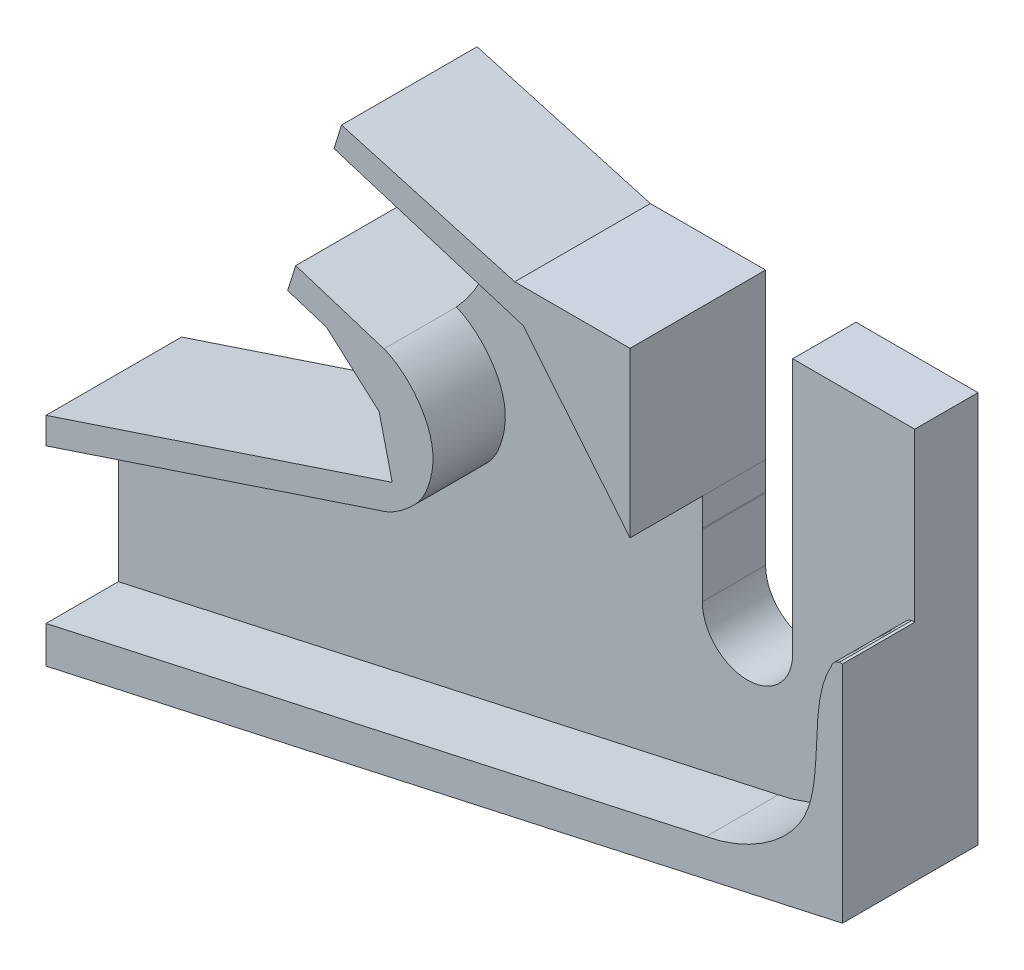
ISO-10303-21;
HEADER;
FILE_DESCRIPTION(('STEP AP214'),'2;1');
FILE_NAME('part.step','',(''),(''),'','','');
FILE_SCHEMA(('AUTOMOTIVE_DESIGN { 1 0 10303 214 1 1 1 1 }'));
ENDSEC;
DATA;
#1=APPLICATION_CONTEXT('core data for automotive mechanical design processes');
#2=APPLICATION_PROTOCOL_DEFINITION('international standard','automotive_design',2000,#1);
#3=PRODUCT_CONTEXT('',#1,'mechanical');
#4=PRODUCT('Part','Part','',(#3));
#5=PRODUCT_RELATED_PRODUCT_CATEGORY('part','',(#4));
#6=PRODUCT_DEFINITION_FORMATION('','',#4);
#7=PRODUCT_DEFINITION_CONTEXT('part definition',#1,'design');
#8=PRODUCT_DEFINITION('design','',#6,#7);
#9=PRODUCT_DEFINITION_SHAPE('','',#8);
#10=(LENGTH_UNIT() NAMED_UNIT(*) SI_UNIT(.MILLI.,.METRE.));
#11=(NAMED_UNIT(*) PLANE_ANGLE_UNIT() SI_UNIT($,.RADIAN.));
#12=(NAMED_UNIT(*) SI_UNIT($,.STERADIAN.) SOLID_ANGLE_UNIT());
#13=UNCERTAINTY_MEASURE_WITH_UNIT(LENGTH_MEASURE(1.E-05),#10,'distance_accuracy_value','');
#14=(GEOMETRIC_REPRESENTATION_CONTEXT(3) GLOBAL_UNCERTAINTY_ASSIGNED_CONTEXT((#13)) GLOBAL_UNIT_ASSIGNED_CONTEXT((#10,
#11,#12)) REPRESENTATION_CONTEXT('',''));
#15=CARTESIAN_POINT('',(0.,0.,0.));
#16=DIRECTION('',(0.,0.,1.));
#17=DIRECTION('',(1.,0.,0.));
#18=AXIS2_PLACEMENT_3D('',#15,#16,#17);
#19=CARTESIAN_POINT('',(83.6786939982744,168.728153838485,7.));
#20=CARTESIAN_POINT('',(88.7746337498864,174.312097995887,7.));
#21=CARTESIAN_POINT('',(88.0764137081904,182.068482242816,7.));
#22=B_SPLINE_CURVE_WITH_KNOTS('',2,(#19,#20,#21),.UNSPECIFIED.,.F.,.F.,(3,3),(0.,1.),.UNSPECIFIED.);
#23=DIRECTION('',(0.,0.,-1.));
#24=VECTOR('',#23,1.);
#25=SURFACE_OF_LINEAR_EXTRUSION('',#22,#24);
#26=CARTESIAN_POINT('',(83.6786939982744,168.728153838485,0.));
#27=CARTESIAN_POINT('',(88.7746337498864,174.312097995887,0.));
#28=CARTESIAN_POINT('',(88.0764137081904,182.068482242816,0.));
#29=B_SPLINE_CURVE_WITH_KNOTS('',2,(#26,#27,#28),.UNSPECIFIED.,.F.,.F.,(3,3),(0.,1.),.UNSPECIFIED.);
#30=CARTESIAN_POINT('',(83.6786939982744,168.728153838485,0.));
#31=VERTEX_POINT('',#30);
#32=CARTESIAN_POINT('',(88.0764137081904,182.068482242816,0.));
#33=VERTEX_POINT('',#32);
#34=EDGE_CURVE('E525',#31,#33,#29,.T.);
#35=ORIENTED_EDGE('',*,*,#34,.F.);
#36=DIRECTION('',(0.,0.,-1.));
#37=VECTOR('',#36,1.);
#38=CARTESIAN_POINT('',(83.6786939982744,168.728153838485,7.));
#39=LINE('',#38,#37);
#40=CARTESIAN_POINT('',(83.6786939982744,168.728153838485,7.));
#41=VERTEX_POINT('',#40);
#42=EDGE_CURVE('E12',#41,#31,#39,.T.);
#43=ORIENTED_EDGE('',*,*,#42,.F.);
#44=CARTESIAN_POINT('',(88.0764137081904,182.068482242816,7.));
#45=VERTEX_POINT('',#44);
#46=EDGE_CURVE('E158',#41,#45,#22,.T.);
#47=ORIENTED_EDGE('',*,*,#46,.T.);
#48=DIRECTION('',(0.,0.,-1.));
#49=VECTOR('',#48,1.);
#50=CARTESIAN_POINT('',(88.0764137081904,182.068482242816,7.));
#51=LINE('',#50,#49);
#52=EDGE_CURVE('E645',#45,#33,#51,.T.);
#53=ORIENTED_EDGE('',*,*,#52,.T.);
#54=EDGE_LOOP('',(#35,#43,#47,#53));
#55=FACE_BOUND('',#54,.T.);
#56=ADVANCED_FACE('F154',(#55),#25,.T.);
#57=CARTESIAN_POINT('',(56.2757722145099,177.420071131067,7.));
#58=DIRECTION('',(-0.302344558633703,-0.953198703243238,0.));
#59=DIRECTION('',(0.953198703243238,-0.302344558633703,0.));
#60=AXIS2_PLACEMENT_3D('',#57,#58,#59);
#61=PLANE('',#60);
#62=DIRECTION('',(-0.953198703243238,0.302344558633703,0.));
#63=VECTOR('',#62,1.);
#64=CARTESIAN_POINT('',(56.2757722145099,177.420071131067,0.));
#65=LINE('',#64,#63);
#66=CARTESIAN_POINT('',(73.917241091847,171.824383575869,0.));
#67=VERTEX_POINT('',#66);
#68=EDGE_CURVE('E569',#31,#67,#65,.T.);
#69=ORIENTED_EDGE('',*,*,#68,.T.);
#70=DIRECTION('',(0.,0.,-1.));
#71=VECTOR('',#70,1.);
#72=CARTESIAN_POINT('',(73.917241091847,171.824383575869,7.));
#73=LINE('',#72,#71);
#74=CARTESIAN_POINT('',(73.917241091847,171.824383575869,15.));
#75=VERTEX_POINT('',#74);
#76=EDGE_CURVE('E164',#75,#67,#73,.T.);
#77=ORIENTED_EDGE('',*,*,#76,.F.);
#78=DIRECTION('',(-0.953198703243238,0.302344558633703,0.));
#79=VECTOR('',#78,1.);
#80=CARTESIAN_POINT('',(56.2757722145099,177.420071131067,15.));
#81=LINE('',#80,#79);
#82=CARTESIAN_POINT('',(83.6786939982744,168.728153838485,15.));
#83=VERTEX_POINT('',#82);
#84=EDGE_CURVE('E430',#83,#75,#81,.T.);
#85=ORIENTED_EDGE('',*,*,#84,.F.);
#86=DIRECTION('',(0.,0.,-1.));
#87=VECTOR('',#86,1.);
#88=CARTESIAN_POINT('',(83.6786939982744,168.728153838485,15.));
#89=LINE('',#88,#87);
#90=EDGE_CURVE('E466',#83,#41,#89,.T.);
#91=ORIENTED_EDGE('',*,*,#90,.T.);
#92=ORIENTED_EDGE('',*,*,#42,.T.);
#93=EDGE_LOOP('',(#69,#77,#85,#91,#92));
#94=FACE_BOUND('',#93,.T.);
#95=ADVANCED_FACE('F841',(#94),#61,.F.);
#96=CARTESIAN_POINT('',(17.6414688773371,-5.59568755519761,7.));
#97=DIRECTION('',(0.953198703243238,-0.302344558633704,0.));
#98=DIRECTION('',(0.302344558633704,0.953198703243238,0.));
#99=AXIS2_PLACEMENT_3D('',#96,#97,#98);
#100=PLANE('',#99);
#101=DIRECTION('',(-0.302344558633704,-0.953198703243238,0.));
#102=VECTOR('',#101,1.);
#103=CARTESIAN_POINT('',(17.6414688773371,-5.59568755519761,0.));
#104=LINE('',#103,#102);
#105=CARTESIAN_POINT('',(73.0183410125951,168.990430175946,0.));
#106=VERTEX_POINT('',#105);
#107=EDGE_CURVE('E575',#67,#106,#104,.T.);
#108=ORIENTED_EDGE('',*,*,#107,.T.);
#109=DIRECTION('',(0.,0.,-1.));
#110=VECTOR('',#109,1.);
#111=CARTESIAN_POINT('',(73.0183410125951,168.990430175946,7.));
#112=LINE('',#111,#110);
#113=CARTESIAN_POINT('',(73.0183410125951,168.990430175946,15.));
#114=VERTEX_POINT('',#113);
#115=EDGE_CURVE('E715',#114,#106,#112,.T.);
#116=ORIENTED_EDGE('',*,*,#115,.F.);
#117=DIRECTION('',(-0.302344558633704,-0.953198703243238,0.));
#118=VECTOR('',#117,1.);
#119=CARTESIAN_POINT('',(17.6414688773371,-5.59568755519761,15.));
#120=LINE('',#119,#118);
#121=EDGE_CURVE('E439',#75,#114,#120,.T.);
#122=ORIENTED_EDGE('',*,*,#121,.F.);
#123=ORIENTED_EDGE('',*,*,#76,.T.);
#124=EDGE_LOOP('',(#108,#116,#122,#123));
#125=FACE_BOUND('',#124,.T.);
#126=ADVANCED_FACE('F725',(#125),#100,.F.);
#127=CARTESIAN_POINT('',(55.3768721352582,174.586117731144,7.));
#128=DIRECTION('',(0.302344558633704,0.953198703243238,0.));
#129=DIRECTION('',(-0.953198703243238,0.302344558633704,0.));
#130=AXIS2_PLACEMENT_3D('',#127,#128,#129);
#131=PLANE('',#130);
#132=DIRECTION('',(0.953198703243238,-0.302344558633704,0.));
#133=VECTOR('',#132,1.);
#134=CARTESIAN_POINT('',(55.3768721352582,174.586117731144,0.));
#135=LINE('',#134,#133);
#136=CARTESIAN_POINT('',(77.2981363976021,167.632924293574,0.));
#137=VERTEX_POINT('',#136);
#138=EDGE_CURVE('E578',#106,#137,#135,.T.);
#139=ORIENTED_EDGE('',*,*,#138,.T.);
#140=DIRECTION('',(0.,0.,-1.));
#141=VECTOR('',#140,1.);
#142=CARTESIAN_POINT('',(77.2981363976021,167.632924293574,7.));
#143=LINE('',#142,#141);
#144=CARTESIAN_POINT('',(77.2981363976021,167.632924293574,15.));
#145=VERTEX_POINT('',#144);
#146=EDGE_CURVE('E711',#145,#137,#143,.T.);
#147=ORIENTED_EDGE('',*,*,#146,.F.);
#148=DIRECTION('',(0.953198703243238,-0.302344558633704,0.));
#149=VECTOR('',#148,1.);
#150=CARTESIAN_POINT('',(55.3768721352582,174.586117731144,15.));
#151=LINE('',#150,#149);
#152=EDGE_CURVE('E443',#114,#145,#151,.T.);
#153=ORIENTED_EDGE('',*,*,#152,.F.);
#154=ORIENTED_EDGE('',*,*,#115,.T.);
#155=EDGE_LOOP('',(#139,#147,#153,#154));
#156=FACE_BOUND('',#155,.T.);
#157=ADVANCED_FACE('F737',(#156),#131,.F.);
#158=CARTESIAN_POINT('',(117.192322274538,132.292301888184,7.));
#159=DIRECTION('',(0.663095933339968,0.74853442351571,0.));
#160=DIRECTION('',(-0.74853442351571,0.663095933339968,0.));
#161=AXIS2_PLACEMENT_3D('',#158,#159,#160);
#162=PLANE('',#161);
#163=DIRECTION('',(0.74853442351571,-0.663095933339968,0.));
#164=VECTOR('',#163,1.);
#165=CARTESIAN_POINT('',(117.192322274538,132.292301888184,0.));
#166=LINE('',#165,#164);
#167=CARTESIAN_POINT('',(83.1348948537238,162.46237946016,0.));
#168=VERTEX_POINT('',#167);
#169=EDGE_CURVE('E581',#137,#168,#166,.T.);
#170=ORIENTED_EDGE('',*,*,#169,.T.);
#171=DIRECTION('',(0.,0.,-1.));
#172=VECTOR('',#171,1.);
#173=CARTESIAN_POINT('',(83.1348948537238,162.46237946016,7.));
#174=LINE('',#173,#172);
#175=CARTESIAN_POINT('',(83.1348948537238,162.46237946016,15.));
#176=VERTEX_POINT('',#175);
#177=EDGE_CURVE('E707',#176,#168,#174,.T.);
#178=ORIENTED_EDGE('',*,*,#177,.F.);
#179=DIRECTION('',(0.74853442351571,-0.663095933339968,0.));
#180=VECTOR('',#179,1.);
#181=CARTESIAN_POINT('',(117.192322274538,132.292301888184,15.));
#182=LINE('',#181,#180);
#183=EDGE_CURVE('E447',#145,#176,#182,.T.);
#184=ORIENTED_EDGE('',*,*,#183,.F.);
#185=ORIENTED_EDGE('',*,*,#146,.T.);
#186=EDGE_LOOP('',(#170,#178,#184,#185));
#187=FACE_BOUND('',#186,.T.);
#188=ADVANCED_FACE('F741',(#187),#162,.F.);
#189=CARTESIAN_POINT('',(115.435467231037,27.6599799177272,7.));
#190=DIRECTION('',(0.972472371101005,0.233018212689887,0.));
#191=DIRECTION('',(-0.233018212689887,0.972472371101005,0.));
#192=AXIS2_PLACEMENT_3D('',#189,#190,#191);
#193=PLANE('',#192);
#194=DIRECTION('',(0.233018212689887,-0.972472371101005,0.));
#195=VECTOR('',#194,1.);
#196=CARTESIAN_POINT('',(115.435467231037,27.6599799177272,0.));
#197=LINE('',#196,#195);
#198=CARTESIAN_POINT('',(84.5894393959199,156.392019708049,0.));
#199=VERTEX_POINT('',#198);
#200=EDGE_CURVE('E584',#168,#199,#197,.T.);
#201=ORIENTED_EDGE('',*,*,#200,.T.);
#202=DIRECTION('',(0.,0.,-1.));
#203=VECTOR('',#202,1.);
#204=CARTESIAN_POINT('',(84.5894393959199,156.392019708049,7.));
#205=LINE('',#204,#203);
#206=CARTESIAN_POINT('',(84.5894393959199,156.392019708049,15.));
#207=VERTEX_POINT('',#206);
#208=EDGE_CURVE('E703',#207,#199,#205,.T.);
#209=ORIENTED_EDGE('',*,*,#208,.F.);
#210=DIRECTION('',(0.233018212689887,-0.972472371101005,0.));
#211=VECTOR('',#210,1.);
#212=CARTESIAN_POINT('',(115.435467231037,27.6599799177272,15.));
#213=LINE('',#212,#211);
#214=EDGE_CURVE('E451',#176,#207,#213,.T.);
#215=ORIENTED_EDGE('',*,*,#214,.F.);
#216=ORIENTED_EDGE('',*,*,#177,.T.);
#217=EDGE_LOOP('',(#201,#209,#215,#216));
#218=FACE_BOUND('',#217,.T.);
#219=ADVANCED_FACE('F746',(#218),#193,.F.);
#220=CARTESIAN_POINT('',(-38.3932698895026,115.517687304981,7.));
#221=DIRECTION('',(0.315394959956781,-0.948960494032212,0.));
#222=DIRECTION('',(0.948960494032212,0.315394959956781,0.));
#223=AXIS2_PLACEMENT_3D('',#220,#221,#222);
#224=PLANE('',#223);
#225=DIRECTION('',(-0.948960494032212,-0.315394959956781,0.));
#226=VECTOR('',#225,1.);
#227=CARTESIAN_POINT('',(-38.3932698895026,115.517687304981,0.));
#228=LINE('',#227,#226);
#229=CARTESIAN_POINT('',(46.2859167985872,143.661523494811,0.));
#230=VERTEX_POINT('',#229);
#231=EDGE_CURVE('E587',#199,#230,#228,.T.);
#232=ORIENTED_EDGE('',*,*,#231,.T.);
#233=DIRECTION('',(0.,0.,-1.));
#234=VECTOR('',#233,1.);
#235=CARTESIAN_POINT('',(46.2859167985872,143.661523494811,7.));
#236=LINE('',#235,#234);
#237=CARTESIAN_POINT('',(46.2859167985872,143.661523494811,15.));
#238=VERTEX_POINT('',#237);
#239=EDGE_CURVE('E699',#238,#230,#236,.T.);
#240=ORIENTED_EDGE('',*,*,#239,.F.);
#241=DIRECTION('',(-0.948960494032212,-0.315394959956781,0.));
#242=VECTOR('',#241,1.);
#243=CARTESIAN_POINT('',(-38.3932698895026,115.517687304981,15.));
#244=LINE('',#243,#242);
#245=EDGE_CURVE('E455',#207,#238,#244,.T.);
#246=ORIENTED_EDGE('',*,*,#245,.F.);
#247=ORIENTED_EDGE('',*,*,#208,.T.);
#248=EDGE_LOOP('',(#232,#240,#246,#247));
#249=FACE_BOUND('',#248,.T.);
#250=ADVANCED_FACE('F749',(#249),#224,.F.);
#251=CARTESIAN_POINT('',(46.2859167985872,0.,7.));
#252=DIRECTION('',(1.,0.,0.));
#253=DIRECTION('',(0.,0.,-1.));
#254=AXIS2_PLACEMENT_3D('',#251,#252,#253);
#255=PLANE('',#254);
#256=DIRECTION('',(0.,-1.,0.));
#257=VECTOR('',#256,1.);
#258=CARTESIAN_POINT('',(46.2859167985872,0.,0.));
#259=LINE('',#258,#257);
#260=CARTESIAN_POINT('',(46.2859167985872,119.6347243386,0.));
#261=VERTEX_POINT('',#260);
#262=EDGE_CURVE('E590',#230,#261,#259,.T.);
#263=ORIENTED_EDGE('',*,*,#262,.T.);
#264=DIRECTION('',(0.,0.,-1.));
#265=VECTOR('',#264,1.);
#266=CARTESIAN_POINT('',(46.2859167985872,119.6347243386,7.));
#267=LINE('',#266,#265);
#268=CARTESIAN_POINT('',(46.2859167985872,119.6347243386,15.));
#269=VERTEX_POINT('',#268);
#270=EDGE_CURVE('E695',#269,#261,#267,.T.);
#271=ORIENTED_EDGE('',*,*,#270,.F.);
#272=DIRECTION('',(0.,-1.,0.));
#273=VECTOR('',#272,1.);
#274=CARTESIAN_POINT('',(46.2859167985872,0.,15.));
#275=LINE('',#274,#273);
#276=CARTESIAN_POINT('',(46.2859167985872,123.72367391825,15.));
#277=VERTEX_POINT('',#276);
#278=EDGE_CURVE('E392',#277,#269,#275,.T.);
#279=ORIENTED_EDGE('',*,*,#278,.F.);
#280=DIRECTION('',(0.,0.,-1.));
#281=VECTOR('',#280,1.);
#282=CARTESIAN_POINT('',(46.2859167985872,123.72367391825,15.));
#283=LINE('',#282,#281);
#284=CARTESIAN_POINT('',(46.2859167985872,123.72367391825,7.));
#285=VERTEX_POINT('',#284);
#286=EDGE_CURVE('E779',#277,#285,#283,.T.);
#287=ORIENTED_EDGE('',*,*,#286,.T.);
#288=DIRECTION('',(0.,-1.,0.));
#289=VECTOR('',#288,1.);
#290=CARTESIAN_POINT('',(46.2859167985872,0.,7.));
#291=LINE('',#290,#289);
#292=CARTESIAN_POINT('',(46.2859167985872,140.738379309567,7.));
#293=VERTEX_POINT('',#292);
#294=EDGE_CURVE('E530',#293,#285,#291,.T.);
#295=ORIENTED_EDGE('',*,*,#294,.F.);
#296=DIRECTION('',(0.,0.,-1.));
#297=VECTOR('',#296,1.);
#298=CARTESIAN_POINT('',(46.2859167985872,140.738379309567,15.));
#299=LINE('',#298,#297);
#300=CARTESIAN_POINT('',(46.2859167985872,140.738379309567,15.));
#301=VERTEX_POINT('',#300);
#302=EDGE_CURVE('E462',#301,#293,#299,.T.);
#303=ORIENTED_EDGE('',*,*,#302,.F.);
#304=DIRECTION('',(0.,-1.,0.));
#305=VECTOR('',#304,1.);
#306=CARTESIAN_POINT('',(46.2859167985872,0.,15.));
#307=LINE('',#306,#305);
#308=EDGE_CURVE('E459',#238,#301,#307,.T.);
#309=ORIENTED_EDGE('',*,*,#308,.F.);
#310=ORIENTED_EDGE('',*,*,#239,.T.);
#311=EDGE_LOOP('',(#263,#271,#279,#287,#295,#303,#309,#310));
#312=FACE_BOUND('',#311,.T.);
#313=ADVANCED_FACE('F753',(#312),#255,.F.);
#314=CARTESIAN_POINT('',(-22.9980527967895,104.367563360401,7.));
#315=DIRECTION('',(-0.215193683277571,0.976571389442386,0.));
#316=DIRECTION('',(-0.976571389442386,-0.215193683277571,0.));
#317=AXIS2_PLACEMENT_3D('',#314,#315,#316);
#318=PLANE('',#317);
#319=DIRECTION('',(0.976571389442386,0.215193683277571,0.));
#320=VECTOR('',#319,1.);
#321=CARTESIAN_POINT('',(-22.9980527967895,104.367563360401,0.));
#322=LINE('',#321,#320);
#323=CARTESIAN_POINT('',(134.39634040415,139.050413550686,0.));
#324=VERTEX_POINT('',#323);
#325=EDGE_CURVE('E593',#261,#324,#322,.T.);
#326=ORIENTED_EDGE('',*,*,#325,.T.);
#327=DIRECTION('',(0.,0.,-1.));
#328=VECTOR('',#327,1.);
#329=CARTESIAN_POINT('',(134.39634040415,139.050413550686,7.));
#330=LINE('',#329,#328);
#331=CARTESIAN_POINT('',(134.39634040415,139.050413550686,15.));
#332=VERTEX_POINT('',#331);
#333=EDGE_CURVE('E691',#332,#324,#330,.T.);
#334=ORIENTED_EDGE('',*,*,#333,.F.);
#335=DIRECTION('',(0.976571389442386,0.215193683277571,0.));
#336=VECTOR('',#335,1.);
#337=CARTESIAN_POINT('',(-22.9980527967895,104.367563360401,15.));
#338=LINE('',#337,#336);
#339=EDGE_CURVE('E761',#269,#332,#338,.T.);
#340=ORIENTED_EDGE('',*,*,#339,.F.);
#341=ORIENTED_EDGE('',*,*,#270,.T.);
#342=EDGE_LOOP('',(#326,#334,#340,#341));
#343=FACE_BOUND('',#342,.T.);
#344=ADVANCED_FACE('F759',(#343),#318,.F.);
#345=CARTESIAN_POINT('',(134.404510715415,0.0078977763166565,7.));
#346=DIRECTION('',(-0.999999998273558,-5.87612444030542E-05,0.));
#347=DIRECTION('',(5.87612444030542E-05,-0.999999998273558,0.));
#348=AXIS2_PLACEMENT_3D('',#345,#346,#347);
#349=PLANE('',#348);
#350=DIRECTION('',(-5.87612444030543E-05,0.999999998273558,0.));
#351=VECTOR('',#350,1.);
#352=CARTESIAN_POINT('',(134.404510715415,0.0078977763166565,7.));
#353=LINE('',#352,#351);
#354=CARTESIAN_POINT('',(134.394880743437,163.890947893081,7.));
#355=VERTEX_POINT('',#354);
#356=CARTESIAN_POINT('',(134.393793889825,182.387043770419,7.));
#357=VERTEX_POINT('',#356);
#358=EDGE_CURVE('E537',#355,#357,#353,.T.);
#359=ORIENTED_EDGE('',*,*,#358,.F.);
#360=DIRECTION('',(0.,0.,-1.));
#361=VECTOR('',#360,1.);
#362=CARTESIAN_POINT('',(134.394880743437,163.890947893081,15.));
#363=LINE('',#362,#361);
#364=CARTESIAN_POINT('',(134.394880743437,163.890947893081,15.));
#365=VERTEX_POINT('',#364);
#366=EDGE_CURVE('E775',#365,#355,#363,.T.);
#367=ORIENTED_EDGE('',*,*,#366,.F.);
#368=DIRECTION('',(-5.87612444030543E-05,0.999999998273558,0.));
#369=VECTOR('',#368,1.);
#370=CARTESIAN_POINT('',(134.404510715415,0.0078977763166565,15.));
#371=LINE('',#370,#369);
#372=EDGE_CURVE('E764',#332,#365,#371,.T.);
#373=ORIENTED_EDGE('',*,*,#372,.F.);
#374=ORIENTED_EDGE('',*,*,#333,.T.);
#375=DIRECTION('',(-5.87612444030543E-05,0.999999998273558,0.));
#376=VECTOR('',#375,1.);
#377=CARTESIAN_POINT('',(134.404510715415,0.0078977763166565,0.));
#378=LINE('',#377,#376);
#379=CARTESIAN_POINT('',(134.393793889825,182.387043770419,0.));
#380=VERTEX_POINT('',#379);
#381=EDGE_CURVE('E596',#324,#380,#378,.T.);
#382=ORIENTED_EDGE('',*,*,#381,.T.);
#383=DIRECTION('',(0.,0.,-1.));
#384=VECTOR('',#383,1.);
#385=CARTESIAN_POINT('',(134.393793889825,182.387043770419,7.));
#386=LINE('',#385,#384);
#387=EDGE_CURVE('E687',#357,#380,#386,.T.);
#388=ORIENTED_EDGE('',*,*,#387,.F.);
#389=EDGE_LOOP('',(#359,#367,#373,#374,#382,#388));
#390=FACE_BOUND('',#389,.T.);
#391=ADVANCED_FACE('F861',(#390),#349,.F.);
#392=CARTESIAN_POINT('',(-0.010716825590548,182.379145994102,7.));
#393=DIRECTION('',(5.87612444045146E-05,-0.999999998273558,0.));
#394=DIRECTION('',(0.999999998273558,5.87612444045146E-05,0.));
#395=AXIS2_PLACEMENT_3D('',#392,#393,#394);
#396=PLANE('',#395);
#397=DIRECTION('',(-0.999999998273558,-5.87612444045146E-05,0.));
#398=VECTOR('',#397,1.);
#399=CARTESIAN_POINT('',(-0.010716825590548,182.379145994102,0.));
#400=LINE('',#399,#398);
#401=CARTESIAN_POINT('',(120.89438868201,182.386250528568,0.));
#402=VERTEX_POINT('',#401);
#403=EDGE_CURVE('E599',#380,#402,#400,.T.);
#404=ORIENTED_EDGE('',*,*,#403,.T.);
#405=DIRECTION('',(0.,0.,-1.));
#406=VECTOR('',#405,1.);
#407=CARTESIAN_POINT('',(120.89438868201,182.386250528568,7.));
#408=LINE('',#407,#406);
#409=CARTESIAN_POINT('',(120.89438868201,182.386250528568,7.));
#410=VERTEX_POINT('',#409);
#411=EDGE_CURVE('E684',#410,#402,#408,.T.);
#412=ORIENTED_EDGE('',*,*,#411,.F.);
#413=DIRECTION('',(-0.999999998273558,-5.87612444045146E-05,0.));
#414=VECTOR('',#413,1.);
#415=CARTESIAN_POINT('',(-0.010716825590548,182.379145994102,7.));
#416=LINE('',#415,#414);
#417=EDGE_CURVE('E540',#357,#410,#416,.T.);
#418=ORIENTED_EDGE('',*,*,#417,.F.);
#419=ORIENTED_EDGE('',*,*,#387,.T.);
#420=EDGE_LOOP('',(#404,#412,#418,#419));
#421=FACE_BOUND('',#420,.T.);
#422=ADVANCED_FACE('F864',(#421),#396,.F.);
#423=CARTESIAN_POINT('',(120.905105507601,0.00710453446698424,7.));
#424=DIRECTION('',(-0.999999998273558,-5.8761244406441E-05,0.));
#425=DIRECTION('',(5.8761244406441E-05,-0.999999998273558,0.));
#426=AXIS2_PLACEMENT_3D('',#423,#424,#425);
#427=PLANE('',#426);
#428=DIRECTION('',(-5.8761244406441E-05,0.999999998273558,0.));
#429=VECTOR('',#428,1.);
#430=CARTESIAN_POINT('',(120.905105507601,0.00710453446698424,0.));
#431=LINE('',#430,#429);
#432=CARTESIAN_POINT('',(120.894655407666,177.847108131035,0.));
#433=VERTEX_POINT('',#432);
#434=EDGE_CURVE('E603',#433,#402,#431,.T.);
#435=ORIENTED_EDGE('',*,*,#434,.F.);
#436=DIRECTION('',(0.,0.,-1.));
#437=VECTOR('',#436,1.);
#438=CARTESIAN_POINT('',(120.894655407666,177.847108131035,7.));
#439=LINE('',#438,#437);
#440=CARTESIAN_POINT('',(120.894655407666,177.847108131035,7.));
#441=VERTEX_POINT('',#440);
#442=EDGE_CURVE('E681',#441,#433,#439,.T.);
#443=ORIENTED_EDGE('',*,*,#442,.F.);
#444=DIRECTION('',(-5.8761244406441E-05,0.999999998273558,0.));
#445=VECTOR('',#444,1.);
#446=CARTESIAN_POINT('',(120.905105507601,0.00710453446698424,7.));
#447=LINE('',#446,#445);
#448=EDGE_CURVE('E543',#441,#410,#447,.T.);
#449=ORIENTED_EDGE('',*,*,#448,.T.);
#450=ORIENTED_EDGE('',*,*,#411,.T.);
#451=EDGE_LOOP('',(#435,#443,#449,#450));
#452=FACE_BOUND('',#451,.T.);
#453=ADVANCED_FACE('F868',(#452),#427,.T.);
#454=CARTESIAN_POINT('',(0.,177.847108131035,7.));
#455=DIRECTION('',(0.,1.,0.));
#456=DIRECTION('',(0.,0.,1.));
#457=AXIS2_PLACEMENT_3D('',#454,#455,#456);
#458=PLANE('',#457);
#459=DIRECTION('',(1.,0.,0.));
#460=VECTOR('',#459,1.);
#461=CARTESIAN_POINT('',(0.,177.847108131035,0.));
#462=LINE('',#461,#460);
#463=CARTESIAN_POINT('',(120.895456025362,177.847108131035,0.));
#464=VERTEX_POINT('',#463);
#465=EDGE_CURVE('E607',#433,#464,#462,.T.);
#466=ORIENTED_EDGE('',*,*,#465,.T.);
#467=DIRECTION('',(0.,0.,-1.));
#468=VECTOR('',#467,1.);
#469=CARTESIAN_POINT('',(120.895456025362,177.847108131035,7.));
#470=LINE('',#469,#468);
#471=CARTESIAN_POINT('',(120.895456025362,177.847108131035,7.));
#472=VERTEX_POINT('',#471);
#473=EDGE_CURVE('E677',#472,#464,#470,.T.);
#474=ORIENTED_EDGE('',*,*,#473,.F.);
#475=DIRECTION('',(1.,0.,0.));
#476=VECTOR('',#475,1.);
#477=CARTESIAN_POINT('',(0.,177.847108131035,7.));
#478=LINE('',#477,#476);
#479=EDGE_CURVE('E547',#441,#472,#478,.T.);
#480=ORIENTED_EDGE('',*,*,#479,.F.);
#481=ORIENTED_EDGE('',*,*,#442,.T.);
#482=EDGE_LOOP('',(#466,#474,#480,#481));
#483=FACE_BOUND('',#482,.T.);
#484=ADVANCED_FACE('F872',(#483),#458,.F.);
#485=CARTESIAN_POINT('',(120.895456025362,0.,7.));
#486=DIRECTION('',(1.,0.,0.));
#487=DIRECTION('',(0.,0.,-1.));
#488=AXIS2_PLACEMENT_3D('',#485,#486,#487);
#489=PLANE('',#488);
#490=DIRECTION('',(0.,-1.,0.));
#491=VECTOR('',#490,1.);
#492=CARTESIAN_POINT('',(120.895456025362,0.,0.));
#493=LINE('',#492,#491);
#494=CARTESIAN_POINT('',(120.895456025362,154.100245398849,0.));
#495=VERTEX_POINT('',#494);
#496=EDGE_CURVE('E610',#464,#495,#493,.T.);
#497=ORIENTED_EDGE('',*,*,#496,.T.);
#498=DIRECTION('',(0.,0.,-1.));
#499=VECTOR('',#498,1.);
#500=CARTESIAN_POINT('',(120.895456025362,154.100245398849,7.));
#501=LINE('',#500,#499);
#502=CARTESIAN_POINT('',(120.895456025362,154.100245398849,7.));
#503=VERTEX_POINT('',#502);
#504=EDGE_CURVE('E674',#503,#495,#501,.T.);
#505=ORIENTED_EDGE('',*,*,#504,.F.);
#506=DIRECTION('',(0.,-1.,0.));
#507=VECTOR('',#506,1.);
#508=CARTESIAN_POINT('',(120.895456025362,0.,7.));
#509=LINE('',#508,#507);
#510=EDGE_CURVE('E550',#472,#503,#509,.T.);
#511=ORIENTED_EDGE('',*,*,#510,.F.);
#512=ORIENTED_EDGE('',*,*,#473,.T.);
#513=EDGE_LOOP('',(#497,#505,#511,#512));
#514=FACE_BOUND('',#513,.T.);
#515=ADVANCED_FACE('F876',(#514),#489,.F.);
#516=CARTESIAN_POINT('',(115.895456025362,154.100245398849,7.));
#517=DIRECTION('',(0.,0.,-1.));
#518=DIRECTION('',(-1.,0.,0.));
#519=AXIS2_PLACEMENT_3D('',#516,#517,#518);
#520=CYLINDRICAL_SURFACE('',#519,5.00000000000001);
#521=CARTESIAN_POINT('',(115.895456025362,154.100245398849,0.));
#522=DIRECTION('',(0.,0.,1.));
#523=DIRECTION('',(1.,0.,0.));
#524=AXIS2_PLACEMENT_3D('',#521,#522,#523);
#525=CIRCLE('',#524,5.00000000000001);
#526=CARTESIAN_POINT('',(110.895456025362,154.100245398849,0.));
#527=VERTEX_POINT('',#526);
#528=EDGE_CURVE('E614',#527,#495,#525,.T.);
#529=ORIENTED_EDGE('',*,*,#528,.F.);
#530=DIRECTION('',(0.,0.,-1.));
#531=VECTOR('',#530,1.);
#532=CARTESIAN_POINT('',(110.895456025362,154.100245398849,7.));
#533=LINE('',#532,#531);
#534=CARTESIAN_POINT('',(110.895456025362,154.100245398849,7.));
#535=VERTEX_POINT('',#534);
#536=EDGE_CURVE('E671',#535,#527,#533,.T.);
#537=ORIENTED_EDGE('',*,*,#536,.F.);
#538=CARTESIAN_POINT('',(115.895456025362,154.100245398849,7.));
#539=DIRECTION('',(0.,0.,1.));
#540=DIRECTION('',(1.,0.,0.));
#541=AXIS2_PLACEMENT_3D('',#538,#539,#540);
#542=CIRCLE('',#541,5.00000000000001);
#543=EDGE_CURVE('E553',#535,#503,#542,.T.);
#544=ORIENTED_EDGE('',*,*,#543,.T.);
#545=ORIENTED_EDGE('',*,*,#504,.T.);
#546=EDGE_LOOP('',(#529,#537,#544,#545));
#547=FACE_BOUND('',#546,.T.);
#548=ADVANCED_FACE('F880',(#547),#520,.F.);
#549=CARTESIAN_POINT('',(110.895456025362,0.,7.));
#550=DIRECTION('',(-1.,0.,0.));
#551=DIRECTION('',(0.,0.,1.));
#552=AXIS2_PLACEMENT_3D('',#549,#550,#551);
#553=PLANE('',#552);
#554=DIRECTION('',(0.,1.,0.));
#555=VECTOR('',#554,1.);
#556=CARTESIAN_POINT('',(110.895456025362,0.,0.));
#557=LINE('',#556,#555);
#558=CARTESIAN_POINT('',(110.895456025362,161.015247015238,0.));
#559=VERTEX_POINT('',#558);
#560=EDGE_CURVE('E618',#527,#559,#557,.T.);
#561=ORIENTED_EDGE('',*,*,#560,.T.);
#562=DIRECTION('',(0.,0.,-1.));
#563=VECTOR('',#562,1.);
#564=CARTESIAN_POINT('',(110.895456025362,161.015247015238,7.));
#565=LINE('',#564,#563);
#566=CARTESIAN_POINT('',(110.895456025362,161.015247015238,7.));
#567=VERTEX_POINT('',#566);
#568=EDGE_CURVE('E667',#567,#559,#565,.T.);
#569=ORIENTED_EDGE('',*,*,#568,.F.);
#570=DIRECTION('',(0.,1.,0.));
#571=VECTOR('',#570,1.);
#572=CARTESIAN_POINT('',(110.895456025362,0.,7.));
#573=LINE('',#572,#571);
#574=EDGE_CURVE('E557',#535,#567,#573,.T.);
#575=ORIENTED_EDGE('',*,*,#574,.F.);
#576=ORIENTED_EDGE('',*,*,#536,.T.);
#577=EDGE_LOOP('',(#561,#569,#575,#576));
#578=FACE_BOUND('',#577,.T.);
#579=ADVANCED_FACE('F884',(#578),#553,.F.);
#580=CARTESIAN_POINT('',(115.895045928337,161.07928452035,7.));
#581=DIRECTION('',(0.,0.,-1.));
#582=DIRECTION('',(-1.,0.,0.));
#583=AXIS2_PLACEMENT_3D('',#580,#581,#582);
#584=CYLINDRICAL_SURFACE('',#583,4.99999999999985);
#585=CARTESIAN_POINT('',(115.895045928337,161.07928452035,0.));
#586=DIRECTION('',(0.,0.,1.));
#587=DIRECTION('',(1.,0.,0.));
#588=AXIS2_PLACEMENT_3D('',#585,#586,#587);
#589=CIRCLE('',#588,4.99999999999985);
#590=CARTESIAN_POINT('',(110.895456025362,161.143322025462,0.));
#591=VERTEX_POINT('',#590);
#592=EDGE_CURVE('E621',#559,#591,#589,.F.);
#593=ORIENTED_EDGE('',*,*,#592,.T.);
#594=DIRECTION('',(0.,0.,-1.));
#595=VECTOR('',#594,1.);
#596=CARTESIAN_POINT('',(110.895456025362,161.143322025462,7.));
#597=LINE('',#596,#595);
#598=CARTESIAN_POINT('',(110.895456025362,161.143322025462,7.));
#599=VERTEX_POINT('',#598);
#600=EDGE_CURVE('E663',#599,#591,#597,.T.);
#601=ORIENTED_EDGE('',*,*,#600,.F.);
#602=CARTESIAN_POINT('',(115.895045928337,161.07928452035,7.));
#603=DIRECTION('',(0.,0.,1.));
#604=DIRECTION('',(1.,0.,0.));
#605=AXIS2_PLACEMENT_3D('',#602,#603,#604);
#606=CIRCLE('',#605,4.99999999999985);
#607=EDGE_CURVE('E560',#567,#599,#606,.F.);
#608=ORIENTED_EDGE('',*,*,#607,.F.);
#609=ORIENTED_EDGE('',*,*,#568,.T.);
#610=EDGE_LOOP('',(#593,#601,#608,#609));
#611=FACE_BOUND('',#610,.T.);
#612=ADVANCED_FACE('F886',(#611),#584,.F.);
#613=CARTESIAN_POINT('',(110.895456025362,164.221886848679,0.));
#614=VERTEX_POINT('',#613);
#615=EDGE_CURVE('E622',#591,#614,#557,.T.);
#616=ORIENTED_EDGE('',*,*,#615,.T.);
#617=DIRECTION('',(0.,0.,-1.));
#618=VECTOR('',#617,1.);
#619=CARTESIAN_POINT('',(110.895456025362,164.221886848679,7.));
#620=LINE('',#619,#618);
#621=CARTESIAN_POINT('',(110.895456025362,164.221886848679,7.));
#622=VERTEX_POINT('',#621);
#623=EDGE_CURVE('E660',#622,#614,#620,.T.);
#624=ORIENTED_EDGE('',*,*,#623,.F.);
#625=EDGE_CURVE('E561',#599,#622,#573,.T.);
#626=ORIENTED_EDGE('',*,*,#625,.F.);
#627=ORIENTED_EDGE('',*,*,#600,.T.);
#628=EDGE_LOOP('',(#616,#624,#626,#627));
#629=FACE_BOUND('',#628,.T.);
#630=ADVANCED_FACE('F825',(#629),#553,.F.);
#631=CARTESIAN_POINT('',(110.905105524862,0.00651692202009418,7.));
#632=DIRECTION('',(0.999999998273558,5.87612443809649E-05,0.));
#633=DIRECTION('',(-5.87612443809649E-05,0.999999998273558,0.));
#634=AXIS2_PLACEMENT_3D('',#631,#632,#633);
#635=PLANE('',#634);
#636=DIRECTION('',(5.87612443809649E-05,-0.999999998273558,0.));
#637=VECTOR('',#636,1.);
#638=CARTESIAN_POINT('',(110.905105524862,0.00651692202009418,0.));
#639=LINE('',#638,#637);
#640=CARTESIAN_POINT('',(110.894388699275,182.385662916124,0.));
#641=VERTEX_POINT('',#640);
#642=EDGE_CURVE('E625',#641,#614,#639,.T.);
#643=ORIENTED_EDGE('',*,*,#642,.F.);
#644=DIRECTION('',(0.,0.,-1.));
#645=VECTOR('',#644,1.);
#646=CARTESIAN_POINT('',(110.894388699275,182.385662916124,7.));
#647=LINE('',#646,#645);
#648=CARTESIAN_POINT('',(110.894388699275,182.385662916124,15.));
#649=VERTEX_POINT('',#648);
#650=EDGE_CURVE('E657',#649,#641,#647,.T.);
#651=ORIENTED_EDGE('',*,*,#650,.F.);
#652=DIRECTION('',(5.87612443809649E-05,-0.999999998273558,0.));
#653=VECTOR('',#652,1.);
#654=CARTESIAN_POINT('',(110.905105524862,0.00651692202009418,15.));
#655=LINE('',#654,#653);
#656=CARTESIAN_POINT('',(110.895456025362,164.221886848679,15.));
#657=VERTEX_POINT('',#656);
#658=EDGE_CURVE('E488',#649,#657,#655,.T.);
#659=ORIENTED_EDGE('',*,*,#658,.T.);
#660=DIRECTION('',(0.,0.,-1.));
#661=VECTOR('',#660,1.);
#662=CARTESIAN_POINT('',(110.895456025362,164.221886848679,15.));
#663=LINE('',#662,#661);
#664=EDGE_CURVE('E511',#657,#622,#663,.T.);
#665=ORIENTED_EDGE('',*,*,#664,.T.);
#666=ORIENTED_EDGE('',*,*,#623,.T.);
#667=EDGE_LOOP('',(#643,#651,#659,#665,#666));
#668=FACE_BOUND('',#667,.T.);
#669=ADVANCED_FACE('F829',(#668),#635,.T.);
#670=CARTESIAN_POINT('',(-0.010716825590548,182.379145994102,7.));
#671=DIRECTION('',(5.87612444045146E-05,-0.999999998273558,0.));
#672=DIRECTION('',(0.999999998273558,5.87612444045146E-05,0.));
#673=AXIS2_PLACEMENT_3D('',#670,#671,#672);
#674=PLANE('',#673);
#675=DIRECTION('',(-0.999999998273558,-5.87612444045146E-05,0.));
#676=VECTOR('',#675,1.);
#677=CARTESIAN_POINT('',(-0.010716825590548,182.379145994102,0.));
#678=LINE('',#677,#676);
#679=CARTESIAN_POINT('',(98.1451367481925,182.384913754213,0.));
#680=VERTEX_POINT('',#679);
#681=EDGE_CURVE('E629',#641,#680,#678,.T.);
#682=ORIENTED_EDGE('',*,*,#681,.T.);
#683=DIRECTION('',(0.,0.,-1.));
#684=VECTOR('',#683,1.);
#685=CARTESIAN_POINT('',(98.1451367481925,182.384913754213,7.));
#686=LINE('',#685,#684);
#687=CARTESIAN_POINT('',(98.1451367481925,182.384913754213,15.));
#688=VERTEX_POINT('',#687);
#689=EDGE_CURVE('E654',#688,#680,#686,.T.);
#690=ORIENTED_EDGE('',*,*,#689,.F.);
#691=DIRECTION('',(-0.999999998273558,-5.87612444045146E-05,0.));
#692=VECTOR('',#691,1.);
#693=CARTESIAN_POINT('',(-0.010716825590548,182.379145994102,15.));
#694=LINE('',#693,#692);
#695=EDGE_CURVE('E492',#649,#688,#694,.T.);
#696=ORIENTED_EDGE('',*,*,#695,.F.);
#697=ORIENTED_EDGE('',*,*,#650,.T.);
#698=EDGE_LOOP('',(#682,#690,#696,#697));
#699=FACE_BOUND('',#698,.T.);
#700=ADVANCED_FACE('F894',(#699),#674,.F.);
#701=CARTESIAN_POINT('',(55.2084342491835,194.568142161782,7.));
#702=DIRECTION('',(0.272972343651028,0.962021881041001,0.));
#703=DIRECTION('',(-0.962021881041001,0.272972343651028,0.));
#704=AXIS2_PLACEMENT_3D('',#701,#702,#703);
#705=PLANE('',#704);
#706=DIRECTION('',(0.962021881041001,-0.272972343651028,0.));
#707=VECTOR('',#706,1.);
#708=CARTESIAN_POINT('',(55.2084342491835,194.568142161782,0.));
#709=LINE('',#708,#707);
#710=CARTESIAN_POINT('',(78.9809880491635,187.822713753928,0.));
#711=VERTEX_POINT('',#710);
#712=EDGE_CURVE('E633',#711,#680,#709,.T.);
#713=ORIENTED_EDGE('',*,*,#712,.F.);
#714=DIRECTION('',(0.,0.,-1.));
#715=VECTOR('',#714,1.);
#716=CARTESIAN_POINT('',(78.9809880491635,187.822713753928,7.));
#717=LINE('',#716,#715);
#718=CARTESIAN_POINT('',(78.9809880491635,187.822713753928,15.));
#719=VERTEX_POINT('',#718);
#720=EDGE_CURVE('E651',#719,#711,#717,.T.);
#721=ORIENTED_EDGE('',*,*,#720,.F.);
#722=DIRECTION('',(0.962021881041001,-0.272972343651028,0.));
#723=VECTOR('',#722,1.);
#724=CARTESIAN_POINT('',(55.2084342491835,194.568142161782,15.));
#725=LINE('',#724,#723);
#726=EDGE_CURVE('E496',#719,#688,#725,.T.);
#727=ORIENTED_EDGE('',*,*,#726,.T.);
#728=ORIENTED_EDGE('',*,*,#689,.T.);
#729=EDGE_LOOP('',(#713,#721,#727,#728));
#730=FACE_BOUND('',#729,.T.);
#731=ADVANCED_FACE('F897',(#730),#705,.T.);
#732=CARTESIAN_POINT('',(18.8971565813214,-5.86216927965748,7.));
#733=DIRECTION('',(-0.955099405328555,0.296285547978704,0.));
#734=DIRECTION('',(-0.296285547978704,-0.955099405328555,0.));
#735=AXIS2_PLACEMENT_3D('',#732,#733,#734);
#736=PLANE('',#735);
#737=DIRECTION('',(0.296285547978704,0.955099405328555,0.));
#738=VECTOR('',#737,1.);
#739=CARTESIAN_POINT('',(18.8971565813214,-5.86216927965748,0.));
#740=LINE('',#739,#738);
#741=CARTESIAN_POINT('',(78.1510863275923,185.147461295071,0.));
#742=VERTEX_POINT('',#741);
#743=EDGE_CURVE('E637',#742,#711,#740,.T.);
#744=ORIENTED_EDGE('',*,*,#743,.F.);
#745=DIRECTION('',(0.,0.,-1.));
#746=VECTOR('',#745,1.);
#747=CARTESIAN_POINT('',(78.1510863275923,185.147461295071,7.));
#748=LINE('',#747,#746);
#749=CARTESIAN_POINT('',(78.1510863275923,185.147461295071,15.));
#750=VERTEX_POINT('',#749);
#751=EDGE_CURVE('E648',#750,#742,#748,.T.);
#752=ORIENTED_EDGE('',*,*,#751,.F.);
#753=DIRECTION('',(0.296285547978704,0.955099405328555,0.));
#754=VECTOR('',#753,1.);
#755=CARTESIAN_POINT('',(18.8971565813214,-5.86216927965748,15.));
#756=LINE('',#755,#754);
#757=EDGE_CURVE('E500',#750,#719,#756,.T.);
#758=ORIENTED_EDGE('',*,*,#757,.T.);
#759=ORIENTED_EDGE('',*,*,#720,.T.);
#760=EDGE_LOOP('',(#744,#752,#758,#759));
#761=FACE_BOUND('',#760,.T.);
#762=ADVANCED_FACE('F901',(#761),#736,.T.);
#763=CARTESIAN_POINT('',(59.2539297462706,191.009630574729,7.));
#764=DIRECTION('',(-0.296285547978702,-0.955099405328555,0.));
#765=DIRECTION('',(0.955099405328556,-0.296285547978702,0.));
#766=AXIS2_PLACEMENT_3D('',#763,#764,#765);
#767=PLANE('',#766);
#768=DIRECTION('',(-0.955099405328555,0.296285547978702,0.));
#769=VECTOR('',#768,1.);
#770=CARTESIAN_POINT('',(59.2539297462706,191.009630574729,0.));
#771=LINE('',#770,#769);
#772=EDGE_CURVE('E641',#33,#742,#771,.T.);
#773=ORIENTED_EDGE('',*,*,#772,.F.);
#774=ORIENTED_EDGE('',*,*,#52,.F.);
#775=DIRECTION('',(0.955099405328556,-0.296285547978702,0.));
#776=VECTOR('',#775,1.);
#777=CARTESIAN_POINT('',(59.2539297462706,191.009630574729,7.));
#778=LINE('',#777,#776);
#779=CARTESIAN_POINT('',(99.0759771154756,178.656259752181,7.));
#780=VERTEX_POINT('',#779);
#781=EDGE_CURVE('E522',#45,#780,#778,.T.);
#782=ORIENTED_EDGE('',*,*,#781,.T.);
#783=DIRECTION('',(0.,0.,-1.));
#784=VECTOR('',#783,1.);
#785=CARTESIAN_POINT('',(99.0759771154757,178.656259752181,15.));
#786=LINE('',#785,#784);
#787=CARTESIAN_POINT('',(99.0759771154757,178.656259752181,15.));
#788=VERTEX_POINT('',#787);
#789=EDGE_CURVE('E515',#788,#780,#786,.T.);
#790=ORIENTED_EDGE('',*,*,#789,.F.);
#791=DIRECTION('',(-0.955099405328555,0.296285547978702,0.));
#792=VECTOR('',#791,1.);
#793=CARTESIAN_POINT('',(59.2539297462706,191.009630574729,15.));
#794=LINE('',#793,#792);
#795=EDGE_CURVE('E504',#788,#750,#794,.T.);
#796=ORIENTED_EDGE('',*,*,#795,.T.);
#797=ORIENTED_EDGE('',*,*,#751,.T.);
#798=EDGE_LOOP('',(#773,#774,#782,#790,#796,#797));
#799=FACE_BOUND('',#798,.T.);
#800=ADVANCED_FACE('F839',(#799),#767,.T.);
#801=CARTESIAN_POINT('',(0.,0.,7.));
#802=DIRECTION('',(0.,0.,1.));
#803=DIRECTION('',(1.,0.,0.));
#804=AXIS2_PLACEMENT_3D('',#801,#802,#803);
#805=PLANE('',#804);
#806=DIRECTION('',(-0.976571389442386,-0.215193683277571,0.));
#807=VECTOR('',#806,1.);
#808=CARTESIAN_POINT('',(-23.8573537054534,108.267160549045,7.));
#809=LINE('',#808,#807);
#810=CARTESIAN_POINT('',(119.308499738105,139.814661996622,7.));
#811=VERTEX_POINT('',#810);
#812=EDGE_CURVE('E172',#811,#285,#809,.T.);
#813=ORIENTED_EDGE('',*,*,#812,.F.);
#814=CARTESIAN_POINT('',(119.308499738105,139.814661996622,7.));
#815=CARTESIAN_POINT('',(123.463953154066,140.563007639153,7.));
#816=CARTESIAN_POINT('',(134.08292107072,146.527888000341,7.));
#817=CARTESIAN_POINT('',(130.55665511211,158.461365550935,7.));
#818=CARTESIAN_POINT('',(133.108709044578,162.917057100045,7.));
#819=B_SPLINE_CURVE_WITH_KNOTS('',3,(#814,#815,#816,#817,#818),.UNSPECIFIED.,.F.,.F.,(4,1,4),
(0.,0.46345557558071,1.),.UNSPECIFIED.);
#820=CARTESIAN_POINT('',(133.108709044578,162.917057100045,7.));
#821=VERTEX_POINT('',#820);
#822=EDGE_CURVE('E176',#821,#811,#819,.F.);
#823=ORIENTED_EDGE('',*,*,#822,.F.);
#824=CARTESIAN_POINT('',(133.108709044578,162.917057100045,7.));
#825=CARTESIAN_POINT('',(133.328673606251,163.69522592854,7.));
#826=CARTESIAN_POINT('',(134.057098699699,163.890947893081,7.));
#827=B_SPLINE_CURVE_WITH_KNOTS('',2,(#824,#825,#826),.UNSPECIFIED.,.F.,.F.,(3,3),(0.,1.),.UNSPECIFIED.);
#828=CARTESIAN_POINT('',(134.057098699699,163.890947893081,7.));
#829=VERTEX_POINT('',#828);
#830=EDGE_CURVE('E369',#829,#821,#827,.F.);
#831=ORIENTED_EDGE('',*,*,#830,.F.);
#832=DIRECTION('',(-1.,0.,0.));
#833=VECTOR('',#832,1.);
#834=CARTESIAN_POINT('',(0.,163.890947893081,7.));
#835=LINE('',#834,#833);
#836=EDGE_CURVE('E373',#355,#829,#835,.T.);
#837=ORIENTED_EDGE('',*,*,#836,.F.);
#838=ORIENTED_EDGE('',*,*,#358,.T.);
#839=ORIENTED_EDGE('',*,*,#417,.T.);
#840=ORIENTED_EDGE('',*,*,#448,.F.);
#841=ORIENTED_EDGE('',*,*,#479,.T.);
#842=ORIENTED_EDGE('',*,*,#510,.T.);
#843=ORIENTED_EDGE('',*,*,#543,.F.);
#844=ORIENTED_EDGE('',*,*,#574,.T.);
#845=ORIENTED_EDGE('',*,*,#607,.T.);
#846=ORIENTED_EDGE('',*,*,#625,.T.);
#847=DIRECTION('',(-0.633543968342301,0.773706688724538,0.));
#848=VECTOR('',#847,1.);
#849=CARTESIAN_POINT('',(146.882289776618,120.273470683944,7.));
#850=LINE('',#849,#848);
#851=EDGE_CURVE('E518',#622,#780,#850,.T.);
#852=ORIENTED_EDGE('',*,*,#851,.T.);
#853=ORIENTED_EDGE('',*,*,#781,.F.);
#854=ORIENTED_EDGE('',*,*,#46,.F.);
#855=CARTESIAN_POINT('',(83.1348948537238,152.985445474319,7.));
#856=CARTESIAN_POINT('',(84.1749275157927,153.23074967984,7.));
#857=CARTESIAN_POINT('',(85.8407487423801,154.283317090409,7.));
#858=CARTESIAN_POINT('',(87.795600380927,156.094817728672,7.));
#859=CARTESIAN_POINT('',(88.8367740518591,158.514861148735,7.));
#860=CARTESIAN_POINT('',(89.6098242943858,162.728645553488,7.));
#861=CARTESIAN_POINT('',(86.4985334139335,167.72859036667,7.));
#862=CARTESIAN_POINT('',(82.7249178911323,169.29109855981,7.));
#863=CARTESIAN_POINT('',(81.0939740350456,168.846419772799,7.));
#864=B_SPLINE_CURVE_WITH_KNOTS('',3,(#855,#856,#857,#858,#859,#860,#861,#862,#863),
.UNSPECIFIED.,.F.,.F.,(4,1,1,1,1,1,4),(0.,0.137401343162474,0.255123746130515,0.340171857480113,
0.476918897134717,0.801613811742631,1.),.UNSPECIFIED.);
#865=CARTESIAN_POINT('',(83.1348948537238,152.985445474319,7.));
#866=VERTEX_POINT('',#865);
#867=EDGE_CURVE('E474',#41,#866,#864,.F.);
#868=ORIENTED_EDGE('',*,*,#867,.T.);
#869=DIRECTION('',(0.948960494032212,0.315394959956781,0.));
#870=VECTOR('',#869,1.);
#871=CARTESIAN_POINT('',(-37.5183805606827,112.885319908196,7.));
#872=LINE('',#871,#870);
#873=EDGE_CURVE('E477',#293,#866,#872,.T.);
#874=ORIENTED_EDGE('',*,*,#873,.F.);
#875=ORIENTED_EDGE('',*,*,#294,.T.);
#876=EDGE_LOOP('',(#813,#823,#831,#837,#838,#839,#840,#841,#842,#843,#844,#845,#846,#852,#853,
#854,#868,#874,#875));
#877=FACE_BOUND('',#876,.T.);
#878=ADVANCED_FACE('F810',(#877),#805,.T.);
#879=CARTESIAN_POINT('',(0.,0.,0.));
#880=DIRECTION('',(0.,0.,1.));
#881=DIRECTION('',(1.,0.,0.));
#882=AXIS2_PLACEMENT_3D('',#879,#880,#881);
#883=PLANE('',#882);
#884=ORIENTED_EDGE('',*,*,#325,.F.);
#885=ORIENTED_EDGE('',*,*,#262,.F.);
#886=ORIENTED_EDGE('',*,*,#231,.F.);
#887=ORIENTED_EDGE('',*,*,#200,.F.);
#888=ORIENTED_EDGE('',*,*,#169,.F.);
#889=ORIENTED_EDGE('',*,*,#138,.F.);
#890=ORIENTED_EDGE('',*,*,#107,.F.);
#891=ORIENTED_EDGE('',*,*,#68,.F.);
#892=ORIENTED_EDGE('',*,*,#34,.T.);
#893=ORIENTED_EDGE('',*,*,#772,.T.);
#894=ORIENTED_EDGE('',*,*,#743,.T.);
#895=ORIENTED_EDGE('',*,*,#712,.T.);
#896=ORIENTED_EDGE('',*,*,#681,.F.);
#897=ORIENTED_EDGE('',*,*,#642,.T.);
#898=ORIENTED_EDGE('',*,*,#615,.F.);
#899=ORIENTED_EDGE('',*,*,#592,.F.);
#900=ORIENTED_EDGE('',*,*,#560,.F.);
#901=ORIENTED_EDGE('',*,*,#528,.T.);
#902=ORIENTED_EDGE('',*,*,#496,.F.);
#903=ORIENTED_EDGE('',*,*,#465,.F.);
#904=ORIENTED_EDGE('',*,*,#434,.T.);
#905=ORIENTED_EDGE('',*,*,#403,.F.);
#906=ORIENTED_EDGE('',*,*,#381,.F.);
#907=EDGE_LOOP('',(#884,#885,#886,#887,#888,#889,#890,#891,#892,#893,#894,#895,#896,#897,#898,
#899,#900,#901,#902,#903,#904,#905,#906));
#908=FACE_BOUND('',#907,.T.);
#909=ADVANCED_FACE('F732',(#908),#883,.F.);
#910=CARTESIAN_POINT('',(146.882289776618,120.273470683944,15.));
#911=DIRECTION('',(0.773706688724538,0.633543968342301,0.));
#912=DIRECTION('',(-0.633543968342301,0.773706688724538,0.));
#913=AXIS2_PLACEMENT_3D('',#910,#911,#912);
#914=PLANE('',#913);
#915=ORIENTED_EDGE('',*,*,#851,.F.);
#916=ORIENTED_EDGE('',*,*,#664,.F.);
#917=DIRECTION('',(0.633543968342301,-0.773706688724538,0.));
#918=VECTOR('',#917,1.);
#919=CARTESIAN_POINT('',(146.882289776618,120.273470683944,15.));
#920=LINE('',#919,#918);
#921=EDGE_CURVE('E508',#788,#657,#920,.T.);
#922=ORIENTED_EDGE('',*,*,#921,.F.);
#923=ORIENTED_EDGE('',*,*,#789,.T.);
#924=EDGE_LOOP('',(#915,#916,#922,#923));
#925=FACE_BOUND('',#924,.T.);
#926=ADVANCED_FACE('F834',(#925),#914,.F.);
#927=CARTESIAN_POINT('',(0.,0.,15.));
#928=DIRECTION('',(0.,0.,1.));
#929=DIRECTION('',(1.,0.,0.));
#930=AXIS2_PLACEMENT_3D('',#927,#928,#929);
#931=PLANE('',#930);
#932=ORIENTED_EDGE('',*,*,#658,.F.);
#933=ORIENTED_EDGE('',*,*,#695,.T.);
#934=ORIENTED_EDGE('',*,*,#726,.F.);
#935=ORIENTED_EDGE('',*,*,#757,.F.);
#936=ORIENTED_EDGE('',*,*,#795,.F.);
#937=ORIENTED_EDGE('',*,*,#921,.T.);
#938=EDGE_LOOP('',(#932,#933,#934,#935,#936,#937));
#939=FACE_BOUND('',#938,.T.);
#940=ADVANCED_FACE('F913',(#939),#931,.T.);
#941=CARTESIAN_POINT('',(-37.5183805606827,112.885319908196,15.));
#942=DIRECTION('',(0.315394959956781,-0.948960494032212,0.));
#943=DIRECTION('',(0.948960494032212,0.315394959956781,0.));
#944=AXIS2_PLACEMENT_3D('',#941,#942,#943);
#945=PLANE('',#944);
#946=ORIENTED_EDGE('',*,*,#302,.T.);
#947=ORIENTED_EDGE('',*,*,#873,.T.);
#948=DIRECTION('',(0.,0.,-1.));
#949=VECTOR('',#948,1.);
#950=CARTESIAN_POINT('',(83.1348948537238,152.985445474319,15.));
#951=LINE('',#950,#949);
#952=CARTESIAN_POINT('',(83.1348948537238,152.985445474319,15.));
#953=VERTEX_POINT('',#952);
#954=EDGE_CURVE('E469',#953,#866,#951,.T.);
#955=ORIENTED_EDGE('',*,*,#954,.F.);
#956=DIRECTION('',(-0.948960494032212,-0.315394959956781,0.));
#957=VECTOR('',#956,1.);
#958=CARTESIAN_POINT('',(-37.5183805606827,112.885319908196,15.));
#959=LINE('',#958,#957);
#960=EDGE_CURVE('E431',#953,#301,#959,.T.);
#961=ORIENTED_EDGE('',*,*,#960,.T.);
#962=EDGE_LOOP('',(#946,#947,#955,#961));
#963=FACE_BOUND('',#962,.T.);
#964=ADVANCED_FACE('F420',(#963),#945,.T.);
#965=CARTESIAN_POINT('',(83.1348948537238,152.985445474319,15.));
#966=CARTESIAN_POINT('',(84.1749275157927,153.23074967984,15.));
#967=CARTESIAN_POINT('',(85.8407487423801,154.283317090409,15.));
#968=CARTESIAN_POINT('',(87.795600380927,156.094817728672,15.));
#969=CARTESIAN_POINT('',(88.8367740518591,158.514861148735,15.));
#970=CARTESIAN_POINT('',(89.6098242943858,162.728645553488,15.));
#971=CARTESIAN_POINT('',(86.4985334139335,167.72859036667,15.));
#972=CARTESIAN_POINT('',(82.7249178911323,169.29109855981,15.));
#973=CARTESIAN_POINT('',(81.0939740350456,168.846419772799,15.));
#974=B_SPLINE_CURVE_WITH_KNOTS('',3,(#965,#966,#967,#968,#969,#970,#971,#972,#973),
.UNSPECIFIED.,.F.,.F.,(4,1,1,1,1,1,4),(0.,0.137401343162474,0.255123746130515,0.340171857480113,
0.476918897134717,0.801613811742631,1.),.UNSPECIFIED.);
#975=DIRECTION('',(0.,0.,-1.));
#976=VECTOR('',#975,1.);
#977=SURFACE_OF_LINEAR_EXTRUSION('',#974,#976);
#978=ORIENTED_EDGE('',*,*,#867,.F.);
#979=ORIENTED_EDGE('',*,*,#90,.F.);
#980=EDGE_CURVE('E423',#953,#83,#974,.T.);
#981=ORIENTED_EDGE('',*,*,#980,.F.);
#982=ORIENTED_EDGE('',*,*,#954,.T.);
#983=EDGE_LOOP('',(#978,#979,#981,#982));
#984=FACE_BOUND('',#983,.T.);
#985=ADVANCED_FACE('F415',(#984),#977,.F.);
#986=CARTESIAN_POINT('',(0.,0.,15.));
#987=DIRECTION('',(0.,0.,1.));
#988=DIRECTION('',(1.,0.,0.));
#989=AXIS2_PLACEMENT_3D('',#986,#987,#988);
#990=PLANE('',#989);
#991=ORIENTED_EDGE('',*,*,#960,.F.);
#992=ORIENTED_EDGE('',*,*,#980,.T.);
#993=ORIENTED_EDGE('',*,*,#84,.T.);
#994=ORIENTED_EDGE('',*,*,#121,.T.);
#995=ORIENTED_EDGE('',*,*,#152,.T.);
#996=ORIENTED_EDGE('',*,*,#183,.T.);
#997=ORIENTED_EDGE('',*,*,#214,.T.);
#998=ORIENTED_EDGE('',*,*,#245,.T.);
#999=ORIENTED_EDGE('',*,*,#308,.T.);
#1000=EDGE_LOOP('',(#991,#992,#993,#994,#995,#996,#997,#998,#999));
#1001=FACE_BOUND('',#1000,.T.);
#1002=ADVANCED_FACE('F412',(#1001),#990,.T.);
#1003=CARTESIAN_POINT('',(133.108709044578,162.917057100045,15.));
#1004=CARTESIAN_POINT('',(133.328673606251,163.69522592854,15.));
#1005=CARTESIAN_POINT('',(134.057098699699,163.890947893081,15.));
#1006=B_SPLINE_CURVE_WITH_KNOTS('',2,(#1003,#1004,#1005),.UNSPECIFIED.,.F.,.F.,(3,3),(0.,1.),.UNSPECIFIED.);
#1007=DIRECTION('',(0.,0.,-1.));
#1008=VECTOR('',#1007,1.);
#1009=SURFACE_OF_LINEAR_EXTRUSION('',#1006,#1008);
#1010=DIRECTION('',(0.,0.,-1.));
#1011=VECTOR('',#1010,1.);
#1012=CARTESIAN_POINT('',(134.057098699699,163.890947893081,15.));
#1013=LINE('',#1012,#1011);
#1014=CARTESIAN_POINT('',(134.057098699699,163.890947893081,15.));
#1015=VERTEX_POINT('',#1014);
#1016=EDGE_CURVE('E772',#1015,#829,#1013,.T.);
#1017=ORIENTED_EDGE('',*,*,#1016,.T.);
#1018=ORIENTED_EDGE('',*,*,#830,.T.);
#1019=DIRECTION('',(0.,0.,-1.));
#1020=VECTOR('',#1019,1.);
#1021=CARTESIAN_POINT('',(133.108709044578,162.917057100045,15.));
#1022=LINE('',#1021,#1020);
#1023=CARTESIAN_POINT('',(133.108709044578,162.917057100045,15.));
#1024=VERTEX_POINT('',#1023);
#1025=EDGE_CURVE('E363',#1024,#821,#1022,.T.);
#1026=ORIENTED_EDGE('',*,*,#1025,.F.);
#1027=EDGE_CURVE('E367',#1024,#1015,#1006,.T.);
#1028=ORIENTED_EDGE('',*,*,#1027,.T.);
#1029=EDGE_LOOP('',(#1017,#1018,#1026,#1028));
#1030=FACE_BOUND('',#1029,.T.);
#1031=ADVANCED_FACE('F366',(#1030),#1009,.T.);
#1032=CARTESIAN_POINT('',(119.308499738105,139.814661996622,15.));
#1033=CARTESIAN_POINT('',(123.463953154066,140.563007639153,15.));
#1034=CARTESIAN_POINT('',(134.08292107072,146.527888000341,15.));
#1035=CARTESIAN_POINT('',(130.55665511211,158.461365550935,15.));
#1036=CARTESIAN_POINT('',(133.108709044578,162.917057100045,15.));
#1037=B_SPLINE_CURVE_WITH_KNOTS('',3,(#1032,#1033,#1034,#1035,#1036),.UNSPECIFIED.,.F.,.F.,(4,1,
4),(0.,0.46345557558071,1.),.UNSPECIFIED.);
#1038=DIRECTION('',(0.,0.,-1.));
#1039=VECTOR('',#1038,1.);
#1040=SURFACE_OF_LINEAR_EXTRUSION('',#1037,#1039);
#1041=ORIENTED_EDGE('',*,*,#1025,.T.);
#1042=ORIENTED_EDGE('',*,*,#822,.T.);
#1043=DIRECTION('',(0.,0.,-1.));
#1044=VECTOR('',#1043,1.);
#1045=CARTESIAN_POINT('',(119.308499738105,139.814661996622,15.));
#1046=LINE('',#1045,#1044);
#1047=CARTESIAN_POINT('',(119.308499738105,139.814661996622,15.));
#1048=VERTEX_POINT('',#1047);
#1049=EDGE_CURVE('E374',#1048,#811,#1046,.T.);
#1050=ORIENTED_EDGE('',*,*,#1049,.F.);
#1051=EDGE_CURVE('E380',#1048,#1024,#1037,.T.);
#1052=ORIENTED_EDGE('',*,*,#1051,.T.);
#1053=EDGE_LOOP('',(#1041,#1042,#1050,#1052));
#1054=FACE_BOUND('',#1053,.T.);
#1055=ADVANCED_FACE('F386',(#1054),#1040,.T.);
#1056=CARTESIAN_POINT('',(-23.8573537054534,108.267160549045,15.));
#1057=DIRECTION('',(-0.215193683277571,0.976571389442386,0.));
#1058=DIRECTION('',(-0.976571389442386,-0.215193683277571,0.));
#1059=AXIS2_PLACEMENT_3D('',#1056,#1057,#1058);
#1060=PLANE('',#1059);
#1061=ORIENTED_EDGE('',*,*,#1049,.T.);
#1062=ORIENTED_EDGE('',*,*,#812,.T.);
#1063=ORIENTED_EDGE('',*,*,#286,.F.);
#1064=DIRECTION('',(0.976571389442386,0.215193683277571,0.));
#1065=VECTOR('',#1064,1.);
#1066=CARTESIAN_POINT('',(-23.8573537054534,108.267160549045,15.));
#1067=LINE('',#1066,#1065);
#1068=EDGE_CURVE('E389',#277,#1048,#1067,.T.);
#1069=ORIENTED_EDGE('',*,*,#1068,.T.);
#1070=EDGE_LOOP('',(#1061,#1062,#1063,#1069));
#1071=FACE_BOUND('',#1070,.T.);
#1072=ADVANCED_FACE('F408',(#1071),#1060,.T.);
#1073=CARTESIAN_POINT('',(0.,163.890947893081,15.));
#1074=DIRECTION('',(0.,1.,0.));
#1075=DIRECTION('',(0.,0.,1.));
#1076=AXIS2_PLACEMENT_3D('',#1073,#1074,#1075);
#1077=PLANE('',#1076);
#1078=ORIENTED_EDGE('',*,*,#366,.T.);
#1079=ORIENTED_EDGE('',*,*,#836,.T.);
#1080=ORIENTED_EDGE('',*,*,#1016,.F.);
#1081=DIRECTION('',(1.,0.,0.));
#1082=VECTOR('',#1081,1.);
#1083=CARTESIAN_POINT('',(0.,163.890947893081,15.));
#1084=LINE('',#1083,#1082);
#1085=EDGE_CURVE('E383',#1015,#365,#1084,.T.);
#1086=ORIENTED_EDGE('',*,*,#1085,.T.);
#1087=EDGE_LOOP('',(#1078,#1079,#1080,#1086));
#1088=FACE_BOUND('',#1087,.T.);
#1089=ADVANCED_FACE('F947',(#1088),#1077,.T.);
#1090=CARTESIAN_POINT('',(0.,0.,15.));
#1091=DIRECTION('',(0.,0.,1.));
#1092=DIRECTION('',(1.,0.,0.));
#1093=AXIS2_PLACEMENT_3D('',#1090,#1091,#1092);
#1094=PLANE('',#1093);
#1095=ORIENTED_EDGE('',*,*,#1027,.F.);
#1096=ORIENTED_EDGE('',*,*,#1051,.F.);
#1097=ORIENTED_EDGE('',*,*,#1068,.F.);
#1098=ORIENTED_EDGE('',*,*,#278,.T.);
#1099=ORIENTED_EDGE('',*,*,#339,.T.);
#1100=ORIENTED_EDGE('',*,*,#372,.T.);
#1101=ORIENTED_EDGE('',*,*,#1085,.F.);
#1102=EDGE_LOOP('',(#1095,#1096,#1097,#1098,#1099,#1100,#1101));
#1103=FACE_BOUND('',#1102,.T.);
#1104=ADVANCED_FACE('F378',(#1103),#1094,.T.);
#1105=CLOSED_SHELL('',(#56,#95,#126,#157,#188,#219,#250,#313,#344,#391,#422,#453,#484,#515,#548,
#579,#612,#630,#669,#700,#731,#762,#800,#878,#909,#926,#940,#964,#985,#1002,#1031,#1055,#1072,
#1089,#1104));
#1106=MANIFOLD_SOLID_BREP('B2',#1105);
#1107=ADVANCED_BREP_SHAPE_REPRESENTATION('',(#18,#1106),#14);
#1108=SHAPE_DEFINITION_REPRESENTATION(#9,#1107);
ENDSEC;
END-ISO-10303-21;
